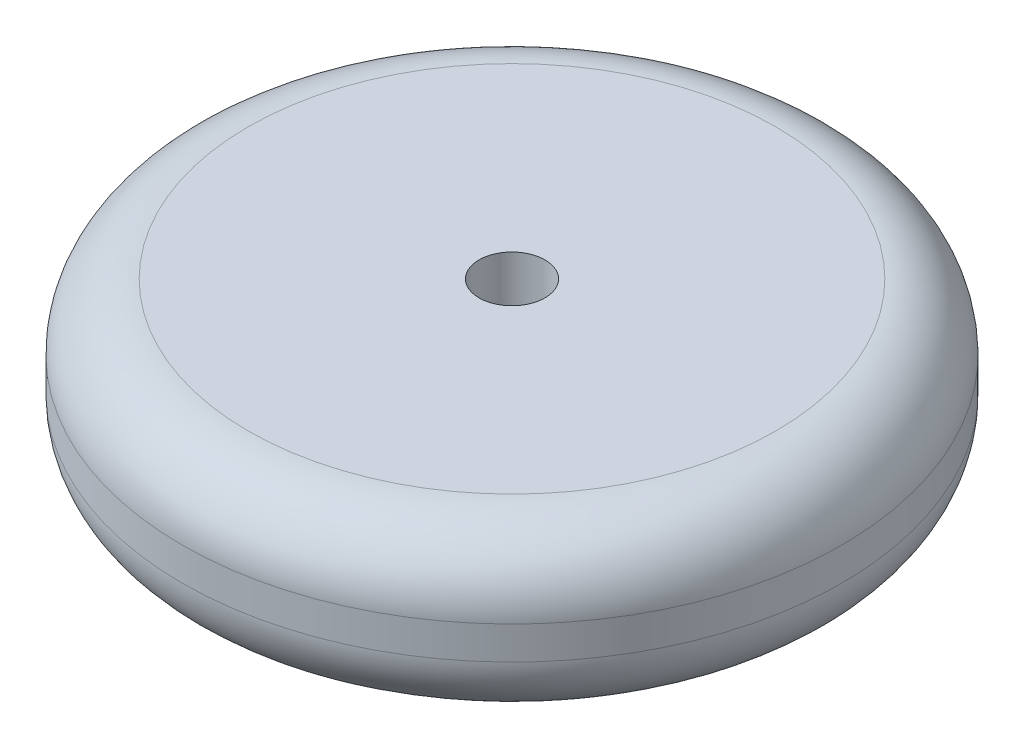
ISO-10303-21;
HEADER;
FILE_DESCRIPTION(('STEP AP214'),'2;1');
FILE_NAME('part.step','',(''),(''),'','','');
FILE_SCHEMA(('AUTOMOTIVE_DESIGN { 1 0 10303 214 1 1 1 1 }'));
ENDSEC;
DATA;
#1=APPLICATION_CONTEXT('core data for automotive mechanical design processes');
#2=APPLICATION_PROTOCOL_DEFINITION('international standard','automotive_design',2000,#1);
#3=PRODUCT_CONTEXT('',#1,'mechanical');
#4=PRODUCT('Part','Part','',(#3));
#5=PRODUCT_RELATED_PRODUCT_CATEGORY('part','',(#4));
#6=PRODUCT_DEFINITION_FORMATION('','',#4);
#7=PRODUCT_DEFINITION_CONTEXT('part definition',#1,'design');
#8=PRODUCT_DEFINITION('design','',#6,#7);
#9=PRODUCT_DEFINITION_SHAPE('','',#8);
#10=(LENGTH_UNIT() NAMED_UNIT(*) SI_UNIT(.MILLI.,.METRE.));
#11=(NAMED_UNIT(*) PLANE_ANGLE_UNIT() SI_UNIT($,.RADIAN.));
#12=(NAMED_UNIT(*) SI_UNIT($,.STERADIAN.) SOLID_ANGLE_UNIT());
#13=UNCERTAINTY_MEASURE_WITH_UNIT(LENGTH_MEASURE(1.E-05),#10,'distance_accuracy_value','');
#14=(GEOMETRIC_REPRESENTATION_CONTEXT(3) GLOBAL_UNCERTAINTY_ASSIGNED_CONTEXT((#13)) GLOBAL_UNIT_ASSIGNED_CONTEXT((#10,
#11,#12)) REPRESENTATION_CONTEXT('',''));
#15=CARTESIAN_POINT('',(0.,0.,0.));
#16=DIRECTION('',(0.,0.,1.));
#17=DIRECTION('',(1.,0.,0.));
#18=AXIS2_PLACEMENT_3D('',#15,#16,#17);
#19=CARTESIAN_POINT('',(0.,10.,0.));
#20=DIRECTION('',(0.,-1.,0.));
#21=DIRECTION('',(0.,0.,-1.));
#22=AXIS2_PLACEMENT_3D('',#19,#20,#21);
#23=CYLINDRICAL_SURFACE('',#22,40.);
#24=CARTESIAN_POINT('',(0.,2.,0.));
#25=DIRECTION('',(0.,1.,0.));
#26=DIRECTION('',(0.,0.,1.));
#27=AXIS2_PLACEMENT_3D('',#24,#25,#26);
#28=CIRCLE('',#27,40.);
#29=CARTESIAN_POINT('',(0.,2.,40.));
#30=VERTEX_POINT('',#29);
#31=EDGE_CURVE('E37',#30,#30,#28,.F.);
#32=ORIENTED_EDGE('',*,*,#31,.T.);
#33=EDGE_LOOP('',(#32));
#34=FACE_BOUND('',#33,.T.);
#35=CARTESIAN_POINT('',(0.,-2.,0.));
#36=DIRECTION('',(0.,1.,0.));
#37=DIRECTION('',(0.,0.,1.));
#38=AXIS2_PLACEMENT_3D('',#35,#36,#37);
#39=CIRCLE('',#38,40.);
#40=CARTESIAN_POINT('',(0.,-2.,40.));
#41=VERTEX_POINT('',#40);
#42=EDGE_CURVE('E41',#41,#41,#39,.T.);
#43=ORIENTED_EDGE('',*,*,#42,.T.);
#44=EDGE_LOOP('',(#43));
#45=FACE_BOUND('',#44,.T.);
#46=ADVANCED_FACE('F30',(#34,#45),#23,.T.);
#47=CARTESIAN_POINT('',(0.,10.,0.));
#48=DIRECTION('',(0.,1.,0.));
#49=DIRECTION('',(0.,0.,1.));
#50=AXIS2_PLACEMENT_3D('',#47,#48,#49);
#51=PLANE('',#50);
#52=CARTESIAN_POINT('',(0.,10.,0.));
#53=DIRECTION('',(0.,1.,0.));
#54=DIRECTION('',(0.,0.,1.));
#55=AXIS2_PLACEMENT_3D('',#52,#53,#54);
#56=CIRCLE('',#55,4.);
#57=CARTESIAN_POINT('',(0.,10.,4.));
#58=VERTEX_POINT('',#57);
#59=EDGE_CURVE('E51',#58,#58,#56,.T.);
#60=ORIENTED_EDGE('',*,*,#59,.F.);
#61=EDGE_LOOP('',(#60));
#62=FACE_BOUND('',#61,.T.);
#63=CARTESIAN_POINT('',(0.,10.,0.));
#64=DIRECTION('',(0.,1.,0.));
#65=DIRECTION('',(0.,0.,1.));
#66=AXIS2_PLACEMENT_3D('',#63,#64,#65);
#67=CIRCLE('',#66,32.);
#68=CARTESIAN_POINT('',(0.,10.,32.));
#69=VERTEX_POINT('',#68);
#70=EDGE_CURVE('E45',#69,#69,#67,.T.);
#71=ORIENTED_EDGE('',*,*,#70,.T.);
#72=EDGE_LOOP('',(#71));
#73=FACE_BOUND('',#72,.T.);
#74=ADVANCED_FACE('F65',(#62,#73),#51,.T.);
#75=CARTESIAN_POINT('',(0.,-10.,0.));
#76=DIRECTION('',(0.,1.,0.));
#77=DIRECTION('',(0.,0.,1.));
#78=AXIS2_PLACEMENT_3D('',#75,#76,#77);
#79=PLANE('',#78);
#80=CARTESIAN_POINT('',(0.,-10.,0.));
#81=DIRECTION('',(0.,1.,0.));
#82=DIRECTION('',(0.,0.,1.));
#83=AXIS2_PLACEMENT_3D('',#80,#81,#82);
#84=CIRCLE('',#83,4.);
#85=CARTESIAN_POINT('',(0.,-10.,4.));
#86=VERTEX_POINT('',#85);
#87=EDGE_CURVE('E50',#86,#86,#84,.T.);
#88=ORIENTED_EDGE('',*,*,#87,.T.);
#89=EDGE_LOOP('',(#88));
#90=FACE_BOUND('',#89,.T.);
#91=CARTESIAN_POINT('',(0.,-10.,0.));
#92=DIRECTION('',(0.,1.,0.));
#93=DIRECTION('',(0.,0.,1.));
#94=AXIS2_PLACEMENT_3D('',#91,#92,#93);
#95=CIRCLE('',#94,32.);
#96=CARTESIAN_POINT('',(0.,-10.,32.));
#97=VERTEX_POINT('',#96);
#98=EDGE_CURVE('E10',#97,#97,#95,.F.);
#99=ORIENTED_EDGE('',*,*,#98,.T.);
#100=EDGE_LOOP('',(#99));
#101=FACE_BOUND('',#100,.T.);
#102=ADVANCED_FACE('F57',(#90,#101),#79,.F.);
#103=CARTESIAN_POINT('',(0.,2.,0.));
#104=DIRECTION('',(0.,1.,0.));
#105=DIRECTION('',(0.,0.,1.));
#106=AXIS2_PLACEMENT_3D('',#103,#104,#105);
#107=TOROIDAL_SURFACE('',#106,32.,8.);
#108=ORIENTED_EDGE('',*,*,#31,.F.);
#109=EDGE_LOOP('',(#108));
#110=FACE_BOUND('',#109,.T.);
#111=ORIENTED_EDGE('',*,*,#70,.F.);
#112=EDGE_LOOP('',(#111));
#113=FACE_BOUND('',#112,.T.);
#114=ADVANCED_FACE('F71',(#110,#113),#107,.T.);
#115=CARTESIAN_POINT('',(0.,-2.,0.));
#116=DIRECTION('',(0.,1.,0.));
#117=DIRECTION('',(0.,0.,1.));
#118=AXIS2_PLACEMENT_3D('',#115,#116,#117);
#119=TOROIDAL_SURFACE('',#118,32.,8.);
#120=ORIENTED_EDGE('',*,*,#98,.F.);
#121=EDGE_LOOP('',(#120));
#122=FACE_BOUND('',#121,.T.);
#123=ORIENTED_EDGE('',*,*,#42,.F.);
#124=EDGE_LOOP('',(#123));
#125=FACE_BOUND('',#124,.T.);
#126=ADVANCED_FACE('F32',(#122,#125),#119,.T.);
#127=CARTESIAN_POINT('',(0.,-10.,0.));
#128=DIRECTION('',(0.,1.,0.));
#129=DIRECTION('',(0.,0.,1.));
#130=AXIS2_PLACEMENT_3D('',#127,#128,#129);
#131=CYLINDRICAL_SURFACE('',#130,4.);
#132=ORIENTED_EDGE('',*,*,#87,.F.);
#133=EDGE_LOOP('',(#132));
#134=FACE_BOUND('',#133,.T.);
#135=ORIENTED_EDGE('',*,*,#59,.T.);
#136=EDGE_LOOP('',(#135));
#137=FACE_BOUND('',#136,.T.);
#138=ADVANCED_FACE('F59',(#134,#137),#131,.F.);
#139=CLOSED_SHELL('',(#46,#74,#102,#114,#126,#138));
#140=MANIFOLD_SOLID_BREP('B2',#139);
#141=ADVANCED_BREP_SHAPE_REPRESENTATION('',(#18,#140),#14);
#142=SHAPE_DEFINITION_REPRESENTATION(#9,#141);
ENDSEC;
END-ISO-10303-21;
